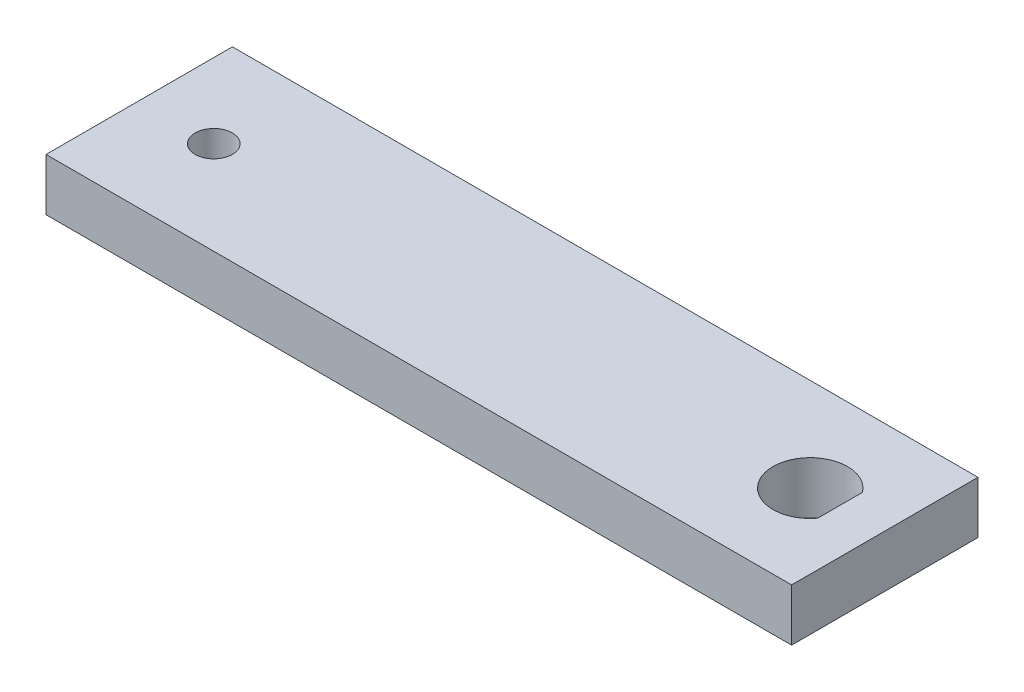
ISO-10303-21;
HEADER;
FILE_DESCRIPTION(('STEP AP214'),'2;1');
FILE_NAME('part.step','',(''),(''),'','','');
FILE_SCHEMA(('AUTOMOTIVE_DESIGN { 1 0 10303 214 1 1 1 1 }'));
ENDSEC;
DATA;
#1=APPLICATION_CONTEXT('core data for automotive mechanical design processes');
#2=APPLICATION_PROTOCOL_DEFINITION('international standard','automotive_design',2000,#1);
#3=PRODUCT_CONTEXT('',#1,'mechanical');
#4=PRODUCT('Part','Part','',(#3));
#5=PRODUCT_RELATED_PRODUCT_CATEGORY('part','',(#4));
#6=PRODUCT_DEFINITION_FORMATION('','',#4);
#7=PRODUCT_DEFINITION_CONTEXT('part definition',#1,'design');
#8=PRODUCT_DEFINITION('design','',#6,#7);
#9=PRODUCT_DEFINITION_SHAPE('','',#8);
#10=(LENGTH_UNIT() NAMED_UNIT(*) SI_UNIT(.MILLI.,.METRE.));
#11=(NAMED_UNIT(*) PLANE_ANGLE_UNIT() SI_UNIT($,.RADIAN.));
#12=(NAMED_UNIT(*) SI_UNIT($,.STERADIAN.) SOLID_ANGLE_UNIT());
#13=UNCERTAINTY_MEASURE_WITH_UNIT(LENGTH_MEASURE(1.E-05),#10,'distance_accuracy_value','');
#14=(GEOMETRIC_REPRESENTATION_CONTEXT(3) GLOBAL_UNCERTAINTY_ASSIGNED_CONTEXT((#13)) GLOBAL_UNIT_ASSIGNED_CONTEXT((#10,
#11,#12)) REPRESENTATION_CONTEXT('',''));
#15=CARTESIAN_POINT('',(0.,0.,0.));
#16=DIRECTION('',(0.,0.,1.));
#17=DIRECTION('',(1.,0.,0.));
#18=AXIS2_PLACEMENT_3D('',#15,#16,#17);
#19=CARTESIAN_POINT('',(0.,0.,25.));
#20=DIRECTION('',(-1.,0.,0.));
#21=DIRECTION('',(0.,0.,1.));
#22=AXIS2_PLACEMENT_3D('',#19,#20,#21);
#23=PLANE('',#22);
#24=DIRECTION('',(0.,1.,0.));
#25=VECTOR('',#24,1.);
#26=CARTESIAN_POINT('',(0.,0.,0.));
#27=LINE('',#26,#25);
#28=CARTESIAN_POINT('',(0.,0.,0.));
#29=VERTEX_POINT('',#28);
#30=CARTESIAN_POINT('',(0.,7.00000000000001,0.));
#31=VERTEX_POINT('',#30);
#32=EDGE_CURVE('E112',#29,#31,#27,.T.);
#33=ORIENTED_EDGE('',*,*,#32,.F.);
#34=DIRECTION('',(0.,0.,-1.));
#35=VECTOR('',#34,1.);
#36=CARTESIAN_POINT('',(0.,0.,25.));
#37=LINE('',#36,#35);
#38=CARTESIAN_POINT('',(0.,0.,25.));
#39=VERTEX_POINT('',#38);
#40=EDGE_CURVE('E11',#39,#29,#37,.T.);
#41=ORIENTED_EDGE('',*,*,#40,.F.);
#42=DIRECTION('',(0.,1.,0.));
#43=VECTOR('',#42,1.);
#44=CARTESIAN_POINT('',(0.,0.,25.));
#45=LINE('',#44,#43);
#46=CARTESIAN_POINT('',(0.,7.00000000000001,25.));
#47=VERTEX_POINT('',#46);
#48=EDGE_CURVE('E114',#39,#47,#45,.T.);
#49=ORIENTED_EDGE('',*,*,#48,.T.);
#50=DIRECTION('',(0.,0.,-1.));
#51=VECTOR('',#50,1.);
#52=CARTESIAN_POINT('',(0.,7.00000000000001,25.));
#53=LINE('',#52,#51);
#54=EDGE_CURVE('E42',#47,#31,#53,.T.);
#55=ORIENTED_EDGE('',*,*,#54,.T.);
#56=EDGE_LOOP('',(#33,#41,#49,#55));
#57=FACE_BOUND('',#56,.T.);
#58=ADVANCED_FACE('F39',(#57),#23,.T.);
#59=CARTESIAN_POINT('',(0.,0.,25.));
#60=DIRECTION('',(0.,1.,0.));
#61=DIRECTION('',(0.,0.,1.));
#62=AXIS2_PLACEMENT_3D('',#59,#60,#61);
#63=PLANE('',#62);
#64=CARTESIAN_POINT('',(10.,0.,12.5));
#65=DIRECTION('',(0.,1.,0.));
#66=DIRECTION('',(-1.,0.,0.));
#67=AXIS2_PLACEMENT_3D('',#64,#65,#66);
#68=CIRCLE('',#67,2.5);
#69=CARTESIAN_POINT('',(7.5,0.,12.5));
#70=VERTEX_POINT('',#69);
#71=EDGE_CURVE('E110',#70,#70,#68,.T.);
#72=ORIENTED_EDGE('',*,*,#71,.T.);
#73=EDGE_LOOP('',(#72));
#74=FACE_BOUND('',#73,.T.);
#75=DIRECTION('',(0.,0.,1.));
#76=VECTOR('',#75,1.);
#77=CARTESIAN_POINT('',(94.,0.,9.50000000000001));
#78=LINE('',#77,#76);
#79=CARTESIAN_POINT('',(94.,0.,9.50000000000001));
#80=VERTEX_POINT('',#79);
#81=CARTESIAN_POINT('',(94.,0.,15.5));
#82=VERTEX_POINT('',#81);
#83=EDGE_CURVE('E91',#80,#82,#78,.T.);
#84=ORIENTED_EDGE('',*,*,#83,.F.);
#85=CARTESIAN_POINT('',(90.,0.,12.5));
#86=DIRECTION('',(0.,1.,0.));
#87=DIRECTION('',(-1.,0.,0.));
#88=AXIS2_PLACEMENT_3D('',#85,#86,#87);
#89=CIRCLE('',#88,5.);
#90=EDGE_CURVE('E55',#80,#82,#89,.T.);
#91=ORIENTED_EDGE('',*,*,#90,.T.);
#92=EDGE_LOOP('',(#84,#91));
#93=FACE_BOUND('',#92,.T.);
#94=DIRECTION('',(1.,0.,0.));
#95=VECTOR('',#94,1.);
#96=CARTESIAN_POINT('',(0.,0.,0.));
#97=LINE('',#96,#95);
#98=CARTESIAN_POINT('',(100.,0.,0.));
#99=VERTEX_POINT('',#98);
#100=EDGE_CURVE('E118',#29,#99,#97,.T.);
#101=ORIENTED_EDGE('',*,*,#100,.T.);
#102=DIRECTION('',(0.,0.,-1.));
#103=VECTOR('',#102,1.);
#104=CARTESIAN_POINT('',(100.,0.,25.));
#105=LINE('',#104,#103);
#106=CARTESIAN_POINT('',(100.,0.,25.));
#107=VERTEX_POINT('',#106);
#108=EDGE_CURVE('E47',#107,#99,#105,.T.);
#109=ORIENTED_EDGE('',*,*,#108,.F.);
#110=DIRECTION('',(1.,0.,0.));
#111=VECTOR('',#110,1.);
#112=CARTESIAN_POINT('',(0.,0.,25.));
#113=LINE('',#112,#111);
#114=EDGE_CURVE('E123',#39,#107,#113,.T.);
#115=ORIENTED_EDGE('',*,*,#114,.F.);
#116=ORIENTED_EDGE('',*,*,#40,.T.);
#117=EDGE_LOOP('',(#101,#109,#115,#116));
#118=FACE_BOUND('',#117,.T.);
#119=ADVANCED_FACE('F101',(#74,#93,#118),#63,.F.);
#120=CARTESIAN_POINT('',(100.,7.00000000000001,25.));
#121=DIRECTION('',(1.,0.,0.));
#122=DIRECTION('',(0.,0.,-1.));
#123=AXIS2_PLACEMENT_3D('',#120,#121,#122);
#124=PLANE('',#123);
#125=DIRECTION('',(0.,-1.,0.));
#126=VECTOR('',#125,1.);
#127=CARTESIAN_POINT('',(100.,7.00000000000001,0.));
#128=LINE('',#127,#126);
#129=CARTESIAN_POINT('',(100.,7.00000000000001,0.));
#130=VERTEX_POINT('',#129);
#131=EDGE_CURVE('E130',#130,#99,#128,.T.);
#132=ORIENTED_EDGE('',*,*,#131,.F.);
#133=DIRECTION('',(0.,0.,-1.));
#134=VECTOR('',#133,1.);
#135=CARTESIAN_POINT('',(100.,7.00000000000001,25.));
#136=LINE('',#135,#134);
#137=CARTESIAN_POINT('',(100.,7.00000000000001,25.));
#138=VERTEX_POINT('',#137);
#139=EDGE_CURVE('E136',#138,#130,#136,.T.);
#140=ORIENTED_EDGE('',*,*,#139,.F.);
#141=DIRECTION('',(0.,-1.,0.));
#142=VECTOR('',#141,1.);
#143=CARTESIAN_POINT('',(100.,7.00000000000001,25.));
#144=LINE('',#143,#142);
#145=EDGE_CURVE('E120',#138,#107,#144,.T.);
#146=ORIENTED_EDGE('',*,*,#145,.T.);
#147=ORIENTED_EDGE('',*,*,#108,.T.);
#148=EDGE_LOOP('',(#132,#140,#146,#147));
#149=FACE_BOUND('',#148,.T.);
#150=ADVANCED_FACE('F155',(#149),#124,.T.);
#151=CARTESIAN_POINT('',(100.,7.00000000000001,25.));
#152=DIRECTION('',(0.,-1.,0.));
#153=DIRECTION('',(0.,0.,-1.));
#154=AXIS2_PLACEMENT_3D('',#151,#152,#153);
#155=PLANE('',#154);
#156=CARTESIAN_POINT('',(10.,7.00000000000001,12.5));
#157=DIRECTION('',(0.,1.,0.));
#158=DIRECTION('',(-1.,0.,0.));
#159=AXIS2_PLACEMENT_3D('',#156,#157,#158);
#160=CIRCLE('',#159,2.5);
#161=CARTESIAN_POINT('',(7.5,7.00000000000001,12.5));
#162=VERTEX_POINT('',#161);
#163=EDGE_CURVE('E107',#162,#162,#160,.T.);
#164=ORIENTED_EDGE('',*,*,#163,.F.);
#165=EDGE_LOOP('',(#164));
#166=FACE_BOUND('',#165,.T.);
#167=DIRECTION('',(0.,0.,1.));
#168=VECTOR('',#167,1.);
#169=CARTESIAN_POINT('',(94.,7.,9.50000000000001));
#170=LINE('',#169,#168);
#171=CARTESIAN_POINT('',(94.,7.,9.50000000000001));
#172=VERTEX_POINT('',#171);
#173=CARTESIAN_POINT('',(94.,7.00000000000001,15.5));
#174=VERTEX_POINT('',#173);
#175=EDGE_CURVE('E103',#172,#174,#170,.T.);
#176=ORIENTED_EDGE('',*,*,#175,.T.);
#177=CARTESIAN_POINT('',(90.,7.,12.5));
#178=DIRECTION('',(0.,1.,0.));
#179=DIRECTION('',(-1.,0.,0.));
#180=AXIS2_PLACEMENT_3D('',#177,#178,#179);
#181=CIRCLE('',#180,5.);
#182=EDGE_CURVE('E60',#172,#174,#181,.T.);
#183=ORIENTED_EDGE('',*,*,#182,.F.);
#184=EDGE_LOOP('',(#176,#183));
#185=FACE_BOUND('',#184,.T.);
#186=DIRECTION('',(-1.,0.,0.));
#187=VECTOR('',#186,1.);
#188=CARTESIAN_POINT('',(100.,7.00000000000001,0.));
#189=LINE('',#188,#187);
#190=EDGE_CURVE('E127',#130,#31,#189,.T.);
#191=ORIENTED_EDGE('',*,*,#190,.T.);
#192=ORIENTED_EDGE('',*,*,#54,.F.);
#193=DIRECTION('',(-1.,0.,0.));
#194=VECTOR('',#193,1.);
#195=CARTESIAN_POINT('',(100.,7.00000000000001,25.));
#196=LINE('',#195,#194);
#197=EDGE_CURVE('E117',#138,#47,#196,.T.);
#198=ORIENTED_EDGE('',*,*,#197,.F.);
#199=ORIENTED_EDGE('',*,*,#139,.T.);
#200=EDGE_LOOP('',(#191,#192,#198,#199));
#201=FACE_BOUND('',#200,.T.);
#202=ADVANCED_FACE('F144',(#166,#185,#201),#155,.F.);
#203=CARTESIAN_POINT('',(0.,7.00000000000001,25.));
#204=DIRECTION('',(0.,0.,1.));
#205=DIRECTION('',(1.,0.,0.));
#206=AXIS2_PLACEMENT_3D('',#203,#204,#205);
#207=PLANE('',#206);
#208=ORIENTED_EDGE('',*,*,#48,.F.);
#209=ORIENTED_EDGE('',*,*,#114,.T.);
#210=ORIENTED_EDGE('',*,*,#145,.F.);
#211=ORIENTED_EDGE('',*,*,#197,.T.);
#212=EDGE_LOOP('',(#208,#209,#210,#211));
#213=FACE_BOUND('',#212,.T.);
#214=ADVANCED_FACE('F153',(#213),#207,.T.);
#215=CARTESIAN_POINT('',(0.,7.00000000000001,0.));
#216=DIRECTION('',(0.,0.,1.));
#217=DIRECTION('',(1.,0.,0.));
#218=AXIS2_PLACEMENT_3D('',#215,#216,#217);
#219=PLANE('',#218);
#220=ORIENTED_EDGE('',*,*,#32,.T.);
#221=ORIENTED_EDGE('',*,*,#190,.F.);
#222=ORIENTED_EDGE('',*,*,#131,.T.);
#223=ORIENTED_EDGE('',*,*,#100,.F.);
#224=EDGE_LOOP('',(#220,#221,#222,#223));
#225=FACE_BOUND('',#224,.T.);
#226=ADVANCED_FACE('F148',(#225),#219,.F.);
#227=CARTESIAN_POINT('',(90.,0.,12.5));
#228=DIRECTION('',(0.,1.,0.));
#229=DIRECTION('',(-1.,0.,0.));
#230=AXIS2_PLACEMENT_3D('',#227,#228,#229);
#231=CYLINDRICAL_SURFACE('',#230,5.);
#232=ORIENTED_EDGE('',*,*,#182,.T.);
#233=DIRECTION('',(0.,1.,0.));
#234=VECTOR('',#233,1.);
#235=CARTESIAN_POINT('',(94.,0.,15.5));
#236=LINE('',#235,#234);
#237=EDGE_CURVE('E94',#82,#174,#236,.T.);
#238=ORIENTED_EDGE('',*,*,#237,.F.);
#239=ORIENTED_EDGE('',*,*,#90,.F.);
#240=DIRECTION('',(0.,1.,0.));
#241=VECTOR('',#240,1.);
#242=CARTESIAN_POINT('',(94.,0.,9.50000000000001));
#243=LINE('',#242,#241);
#244=EDGE_CURVE('E96',#80,#172,#243,.T.);
#245=ORIENTED_EDGE('',*,*,#244,.T.);
#246=EDGE_LOOP('',(#232,#238,#239,#245));
#247=FACE_BOUND('',#246,.T.);
#248=ADVANCED_FACE('F99',(#247),#231,.F.);
#249=CARTESIAN_POINT('',(94.,0.,9.50000000000001));
#250=DIRECTION('',(-1.,0.,0.));
#251=DIRECTION('',(0.,-1.,0.));
#252=AXIS2_PLACEMENT_3D('',#249,#250,#251);
#253=PLANE('',#252);
#254=ORIENTED_EDGE('',*,*,#175,.F.);
#255=ORIENTED_EDGE('',*,*,#244,.F.);
#256=ORIENTED_EDGE('',*,*,#83,.T.);
#257=ORIENTED_EDGE('',*,*,#237,.T.);
#258=EDGE_LOOP('',(#254,#255,#256,#257));
#259=FACE_BOUND('',#258,.T.);
#260=ADVANCED_FACE('F93',(#259),#253,.T.);
#261=CARTESIAN_POINT('',(10.,0.,12.5));
#262=DIRECTION('',(0.,1.,0.));
#263=DIRECTION('',(-1.,0.,0.));
#264=AXIS2_PLACEMENT_3D('',#261,#262,#263);
#265=CYLINDRICAL_SURFACE('',#264,2.5);
#266=ORIENTED_EDGE('',*,*,#71,.F.);
#267=EDGE_LOOP('',(#266));
#268=FACE_BOUND('',#267,.T.);
#269=ORIENTED_EDGE('',*,*,#163,.T.);
#270=EDGE_LOOP('',(#269));
#271=FACE_BOUND('',#270,.T.);
#272=ADVANCED_FACE('F194',(#268,#271),#265,.F.);
#273=CLOSED_SHELL('',(#58,#119,#150,#202,#214,#226,#248,#260,#272));
#274=MANIFOLD_SOLID_BREP('B2',#273);
#275=ADVANCED_BREP_SHAPE_REPRESENTATION('',(#18,#274),#14);
#276=SHAPE_DEFINITION_REPRESENTATION(#9,#275);
ENDSEC;
END-ISO-10303-21;
